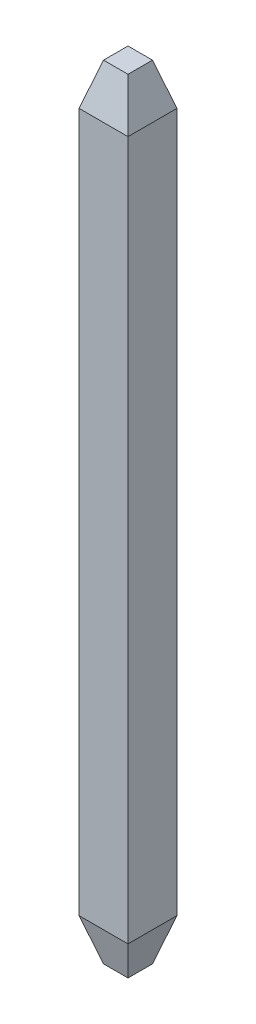
ISO-10303-21;
HEADER;
FILE_DESCRIPTION(('STEP AP214'),'2;1');
FILE_NAME('part.step','',(''),(''),'','','');
FILE_SCHEMA(('AUTOMOTIVE_DESIGN { 1 0 10303 214 1 1 1 1 }'));
ENDSEC;
DATA;
#1=APPLICATION_CONTEXT('core data for automotive mechanical design processes');
#2=APPLICATION_PROTOCOL_DEFINITION('international standard','automotive_design',2000,#1);
#3=PRODUCT_CONTEXT('',#1,'mechanical');
#4=PRODUCT('Part','Part','',(#3));
#5=PRODUCT_RELATED_PRODUCT_CATEGORY('part','',(#4));
#6=PRODUCT_DEFINITION_FORMATION('','',#4);
#7=PRODUCT_DEFINITION_CONTEXT('part definition',#1,'design');
#8=PRODUCT_DEFINITION('design','',#6,#7);
#9=PRODUCT_DEFINITION_SHAPE('','',#8);
#10=(LENGTH_UNIT() NAMED_UNIT(*) SI_UNIT(.MILLI.,.METRE.));
#11=(NAMED_UNIT(*) PLANE_ANGLE_UNIT() SI_UNIT($,.RADIAN.));
#12=(NAMED_UNIT(*) SI_UNIT($,.STERADIAN.) SOLID_ANGLE_UNIT());
#13=UNCERTAINTY_MEASURE_WITH_UNIT(LENGTH_MEASURE(1.E-05),#10,'distance_accuracy_value','');
#14=(GEOMETRIC_REPRESENTATION_CONTEXT(3) GLOBAL_UNCERTAINTY_ASSIGNED_CONTEXT((#13)) GLOBAL_UNIT_ASSIGNED_CONTEXT((#10,
#11,#12)) REPRESENTATION_CONTEXT('',''));
#15=CARTESIAN_POINT('',(0.,0.,0.));
#16=DIRECTION('',(0.,0.,1.));
#17=DIRECTION('',(1.,0.,0.));
#18=AXIS2_PLACEMENT_3D('',#15,#16,#17);
#19=CARTESIAN_POINT('',(-19.209999999987,-5.53543505344796,-16.6589999999763));
#20=DIRECTION('',(-1.,0.,0.));
#21=DIRECTION('',(0.,0.,1.));
#22=AXIS2_PLACEMENT_3D('',#19,#20,#21);
#23=PLANE('',#22);
#24=DIRECTION('',(0.,1.,0.));
#25=VECTOR('',#24,1.);
#26=CARTESIAN_POINT('',(-19.209999999987,-10.1039999999832,-17.2999999999763));
#27=LINE('',#26,#25);
#28=CARTESIAN_POINT('',(-19.209999999987,-10.1039999999832,-17.2999999999763));
#29=VERTEX_POINT('',#28);
#30=CARTESIAN_POINT('',(-19.209999999987,-0.965870106912723,-17.2999999999763));
#31=VERTEX_POINT('',#30);
#32=EDGE_CURVE('E152',#29,#31,#27,.T.);
#33=ORIENTED_EDGE('',*,*,#32,.F.);
#34=DIRECTION('',(0.,0.,-1.));
#35=VECTOR('',#34,1.);
#36=CARTESIAN_POINT('',(-19.209999999987,-10.1039999999832,-16.6599999999763));
#37=LINE('',#36,#35);
#38=CARTESIAN_POINT('',(-19.209999999987,-10.1039999999832,-16.6599999999763));
#39=VERTEX_POINT('',#38);
#40=EDGE_CURVE('E21',#39,#29,#37,.T.);
#41=ORIENTED_EDGE('',*,*,#40,.F.);
#42=DIRECTION('',(0.,1.,0.));
#43=VECTOR('',#42,1.);
#44=CARTESIAN_POINT('',(-19.209999999987,-10.1039999999832,-16.6599999999763));
#45=LINE('',#44,#43);
#46=CARTESIAN_POINT('',(-19.209999999987,-0.965870106912723,-16.6599999999763));
#47=VERTEX_POINT('',#46);
#48=EDGE_CURVE('E11',#39,#47,#45,.T.);
#49=ORIENTED_EDGE('',*,*,#48,.T.);
#50=DIRECTION('',(0.,0.,-1.));
#51=VECTOR('',#50,1.);
#52=CARTESIAN_POINT('',(-19.209999999987,-0.965870106912721,-16.6599999999763));
#53=LINE('',#52,#51);
#54=EDGE_CURVE('E27',#47,#31,#53,.T.);
#55=ORIENTED_EDGE('',*,*,#54,.T.);
#56=EDGE_LOOP('',(#33,#41,#49,#55));
#57=FACE_BOUND('',#56,.T.);
#58=ADVANCED_FACE('F17',(#57),#23,.T.);
#59=CARTESIAN_POINT('',(-18.568999999987,-5.53443505344796,-17.2999999999763));
#60=DIRECTION('',(0.,0.,-1.));
#61=DIRECTION('',(0.,-1.,0.));
#62=AXIS2_PLACEMENT_3D('',#59,#60,#61);
#63=PLANE('',#62);
#64=DIRECTION('',(0.,1.,0.));
#65=VECTOR('',#64,1.);
#66=CARTESIAN_POINT('',(-18.569999999987,-10.1039999999832,-17.2999999999763));
#67=LINE('',#66,#65);
#68=CARTESIAN_POINT('',(-18.569999999987,-10.1039999999832,-17.2999999999763));
#69=VERTEX_POINT('',#68);
#70=CARTESIAN_POINT('',(-18.569999999987,-0.965870106912723,-17.2999999999763));
#71=VERTEX_POINT('',#70);
#72=EDGE_CURVE('E216',#69,#71,#67,.T.);
#73=ORIENTED_EDGE('',*,*,#72,.F.);
#74=DIRECTION('',(1.,0.,0.));
#75=VECTOR('',#74,1.);
#76=CARTESIAN_POINT('',(-19.209999999987,-10.1039999999832,-17.2999999999763));
#77=LINE('',#76,#75);
#78=EDGE_CURVE('E162',#29,#69,#77,.T.);
#79=ORIENTED_EDGE('',*,*,#78,.F.);
#80=ORIENTED_EDGE('',*,*,#32,.T.);
#81=DIRECTION('',(1.,0.,0.));
#82=VECTOR('',#81,1.);
#83=CARTESIAN_POINT('',(-19.209999999987,-0.965870106912721,-17.2999999999763));
#84=LINE('',#83,#82);
#85=EDGE_CURVE('E156',#31,#71,#84,.T.);
#86=ORIENTED_EDGE('',*,*,#85,.T.);
#87=EDGE_LOOP('',(#73,#79,#80,#86));
#88=FACE_BOUND('',#87,.T.);
#89=ADVANCED_FACE('F245',(#88),#63,.T.);
#90=CARTESIAN_POINT('',(-18.569999999987,-11.0738701069127,-16.9799999999763));
#91=DIRECTION('',(1.,0.,0.));
#92=DIRECTION('',(0.,1.,0.));
#93=AXIS2_PLACEMENT_3D('',#90,#91,#92);
#94=PLANE('',#93);
#95=DIRECTION('',(0.,1.,0.));
#96=VECTOR('',#95,1.);
#97=CARTESIAN_POINT('',(-18.569999999987,-10.1039999999832,-16.6599999999763));
#98=LINE('',#97,#96);
#99=CARTESIAN_POINT('',(-18.569999999987,-10.1039999999832,-16.6599999999763));
#100=VERTEX_POINT('',#99);
#101=CARTESIAN_POINT('',(-18.569999999987,-0.965870106912723,-16.6599999999763));
#102=VERTEX_POINT('',#101);
#103=EDGE_CURVE('E76',#100,#102,#98,.T.);
#104=ORIENTED_EDGE('',*,*,#103,.F.);
#105=DIRECTION('',(0.,0.,1.));
#106=VECTOR('',#105,1.);
#107=CARTESIAN_POINT('',(-18.569999999987,-10.1039999999832,-17.2999999999763));
#108=LINE('',#107,#106);
#109=EDGE_CURVE('E206',#69,#100,#108,.T.);
#110=ORIENTED_EDGE('',*,*,#109,.F.);
#111=ORIENTED_EDGE('',*,*,#72,.T.);
#112=DIRECTION('',(0.,0.,1.));
#113=VECTOR('',#112,1.);
#114=CARTESIAN_POINT('',(-18.569999999987,-0.965870106912721,-17.2999999999763));
#115=LINE('',#114,#113);
#116=EDGE_CURVE('E64',#71,#102,#115,.T.);
#117=ORIENTED_EDGE('',*,*,#116,.T.);
#118=EDGE_LOOP('',(#104,#110,#111,#117));
#119=FACE_BOUND('',#118,.T.);
#120=ADVANCED_FACE('F252',(#119),#94,.T.);
#121=CARTESIAN_POINT('',(-18.569999999987,-0.965870106912721,-16.9799999999763));
#122=DIRECTION('',(0.959644900900968,0.281214622974643,0.));
#123=DIRECTION('',(0.,0.,-1.));
#124=AXIS2_PLACEMENT_3D('',#121,#122,#123);
#125=PLANE('',#124);
#126=DIRECTION('',(-0.270714017147727,0.923811583516617,0.270714017147727));
#127=VECTOR('',#126,1.);
#128=CARTESIAN_POINT('',(-18.569999999987,-0.965870106912721,-17.2999999999763));
#129=LINE('',#128,#127);
#130=CARTESIAN_POINT('',(-18.729999999987,-0.419870106912724,-17.1399999999763));
#131=VERTEX_POINT('',#130);
#132=EDGE_CURVE('E166',#71,#131,#129,.T.);
#133=ORIENTED_EDGE('',*,*,#132,.T.);
#134=DIRECTION('',(0.,0.,1.));
#135=VECTOR('',#134,1.);
#136=CARTESIAN_POINT('',(-18.729999999987,-0.419870106912722,-17.1399999999763));
#137=LINE('',#136,#135);
#138=CARTESIAN_POINT('',(-18.729999999987,-0.419870106912724,-16.8199999999763));
#139=VERTEX_POINT('',#138);
#140=EDGE_CURVE('E163',#131,#139,#137,.T.);
#141=ORIENTED_EDGE('',*,*,#140,.T.);
#142=DIRECTION('',(-0.270714017147727,0.923811583516617,-0.270714017147727));
#143=VECTOR('',#142,1.);
#144=CARTESIAN_POINT('',(-18.569999999987,-0.965870106912721,-16.6599999999763));
#145=LINE('',#144,#143);
#146=EDGE_CURVE('E167',#102,#139,#145,.T.);
#147=ORIENTED_EDGE('',*,*,#146,.F.);
#148=ORIENTED_EDGE('',*,*,#116,.F.);
#149=EDGE_LOOP('',(#133,#141,#147,#148));
#150=FACE_BOUND('',#149,.T.);
#151=ADVANCED_FACE('F271',(#150),#125,.T.);
#152=CARTESIAN_POINT('',(-18.889999999987,-0.965870106912721,-16.6599999999763));
#153=DIRECTION('',(0.,0.281214622974643,0.959644900900968));
#154=DIRECTION('',(1.,0.,0.));
#155=AXIS2_PLACEMENT_3D('',#152,#153,#154);
#156=PLANE('',#155);
#157=ORIENTED_EDGE('',*,*,#146,.T.);
#158=DIRECTION('',(-1.,0.,0.));
#159=VECTOR('',#158,1.);
#160=CARTESIAN_POINT('',(-18.729999999987,-0.419870106912722,-16.8199999999763));
#161=LINE('',#160,#159);
#162=CARTESIAN_POINT('',(-19.049999999987,-0.419870106912724,-16.8199999999763));
#163=VERTEX_POINT('',#162);
#164=EDGE_CURVE('E188',#139,#163,#161,.T.);
#165=ORIENTED_EDGE('',*,*,#164,.T.);
#166=DIRECTION('',(0.270714017147727,0.923811583516617,-0.270714017147727));
#167=VECTOR('',#166,1.);
#168=CARTESIAN_POINT('',(-19.209999999987,-0.965870106912721,-16.6599999999763));
#169=LINE('',#168,#167);
#170=EDGE_CURVE('E168',#47,#163,#169,.T.);
#171=ORIENTED_EDGE('',*,*,#170,.F.);
#172=DIRECTION('',(-1.,0.,0.));
#173=VECTOR('',#172,1.);
#174=CARTESIAN_POINT('',(-18.569999999987,-0.965870106912721,-16.6599999999763));
#175=LINE('',#174,#173);
#176=EDGE_CURVE('E148',#102,#47,#175,.T.);
#177=ORIENTED_EDGE('',*,*,#176,.F.);
#178=EDGE_LOOP('',(#157,#165,#171,#177));
#179=FACE_BOUND('',#178,.T.);
#180=ADVANCED_FACE('F238',(#179),#156,.T.);
#181=CARTESIAN_POINT('',(-18.889999999987,-0.419870106912722,-17.1409999999763));
#182=DIRECTION('',(0.,1.,0.));
#183=DIRECTION('',(1.,0.,0.));
#184=AXIS2_PLACEMENT_3D('',#181,#182,#183);
#185=PLANE('',#184);
#186=DIRECTION('',(1.,0.,0.));
#187=VECTOR('',#186,1.);
#188=CARTESIAN_POINT('',(-19.049999999987,-0.419870106912722,-17.1399999999763));
#189=LINE('',#188,#187);
#190=CARTESIAN_POINT('',(-19.049999999987,-0.419870106912724,-17.1399999999763));
#191=VERTEX_POINT('',#190);
#192=EDGE_CURVE('E157',#191,#131,#189,.T.);
#193=ORIENTED_EDGE('',*,*,#192,.F.);
#194=DIRECTION('',(0.,0.,-1.));
#195=VECTOR('',#194,1.);
#196=CARTESIAN_POINT('',(-19.049999999987,-0.419870106912722,-16.8199999999763));
#197=LINE('',#196,#195);
#198=EDGE_CURVE('E170',#163,#191,#197,.T.);
#199=ORIENTED_EDGE('',*,*,#198,.F.);
#200=ORIENTED_EDGE('',*,*,#164,.F.);
#201=ORIENTED_EDGE('',*,*,#140,.F.);
#202=EDGE_LOOP('',(#193,#199,#200,#201));
#203=FACE_BOUND('',#202,.T.);
#204=ADVANCED_FACE('F257',(#203),#185,.T.);
#205=CARTESIAN_POINT('',(-18.569999999987,-10.1039999999832,-16.9799999999763));
#206=DIRECTION('',(0.959644900900968,-0.281214622974643,0.));
#207=DIRECTION('',(0.,0.,-1.));
#208=AXIS2_PLACEMENT_3D('',#205,#206,#207);
#209=PLANE('',#208);
#210=ORIENTED_EDGE('',*,*,#109,.T.);
#211=DIRECTION('',(-0.270714017147727,-0.923811583516618,-0.270714017147727));
#212=VECTOR('',#211,1.);
#213=CARTESIAN_POINT('',(-18.569999999987,-10.1039999999832,-16.6599999999763));
#214=LINE('',#213,#212);
#215=CARTESIAN_POINT('',(-18.729999999987,-10.6499999999832,-16.8199999999763));
#216=VERTEX_POINT('',#215);
#217=EDGE_CURVE('E200',#100,#216,#214,.T.);
#218=ORIENTED_EDGE('',*,*,#217,.T.);
#219=DIRECTION('',(0.,0.,1.));
#220=VECTOR('',#219,1.);
#221=CARTESIAN_POINT('',(-18.729999999987,-10.6499999999832,-17.1399999999763));
#222=LINE('',#221,#220);
#223=CARTESIAN_POINT('',(-18.729999999987,-10.6499999999832,-17.1399999999763));
#224=VERTEX_POINT('',#223);
#225=EDGE_CURVE('E198',#224,#216,#222,.T.);
#226=ORIENTED_EDGE('',*,*,#225,.F.);
#227=DIRECTION('',(-0.270714017147727,-0.923811583516618,0.270714017147727));
#228=VECTOR('',#227,1.);
#229=CARTESIAN_POINT('',(-18.569999999987,-10.1039999999832,-17.2999999999763));
#230=LINE('',#229,#228);
#231=EDGE_CURVE('E112',#69,#224,#230,.T.);
#232=ORIENTED_EDGE('',*,*,#231,.F.);
#233=EDGE_LOOP('',(#210,#218,#226,#232));
#234=FACE_BOUND('',#233,.T.);
#235=ADVANCED_FACE('F268',(#234),#209,.T.);
#236=CARTESIAN_POINT('',(-19.050999999987,-10.6499999999832,-16.9799999999763));
#237=DIRECTION('',(0.,-1.,0.));
#238=DIRECTION('',(0.,0.,-1.));
#239=AXIS2_PLACEMENT_3D('',#236,#237,#238);
#240=PLANE('',#239);
#241=ORIENTED_EDGE('',*,*,#225,.T.);
#242=DIRECTION('',(-1.,0.,0.));
#243=VECTOR('',#242,1.);
#244=CARTESIAN_POINT('',(-18.729999999987,-10.6499999999832,-16.8199999999763));
#245=LINE('',#244,#243);
#246=CARTESIAN_POINT('',(-19.049999999987,-10.6499999999832,-16.8199999999763));
#247=VERTEX_POINT('',#246);
#248=EDGE_CURVE('E138',#216,#247,#245,.T.);
#249=ORIENTED_EDGE('',*,*,#248,.T.);
#250=DIRECTION('',(0.,0.,-1.));
#251=VECTOR('',#250,1.);
#252=CARTESIAN_POINT('',(-19.049999999987,-10.6499999999832,-16.8199999999763));
#253=LINE('',#252,#251);
#254=CARTESIAN_POINT('',(-19.049999999987,-10.6499999999832,-17.1399999999763));
#255=VERTEX_POINT('',#254);
#256=EDGE_CURVE('E123',#247,#255,#253,.T.);
#257=ORIENTED_EDGE('',*,*,#256,.T.);
#258=DIRECTION('',(1.,0.,0.));
#259=VECTOR('',#258,1.);
#260=CARTESIAN_POINT('',(-19.049999999987,-10.6499999999832,-17.1399999999763));
#261=LINE('',#260,#259);
#262=EDGE_CURVE('E129',#255,#224,#261,.T.);
#263=ORIENTED_EDGE('',*,*,#262,.T.);
#264=EDGE_LOOP('',(#241,#249,#257,#263));
#265=FACE_BOUND('',#264,.T.);
#266=ADVANCED_FACE('F136',(#265),#240,.T.);
#267=CARTESIAN_POINT('',(-18.889999999987,-10.1039999999832,-16.6599999999763));
#268=DIRECTION('',(0.,-0.281214622974643,0.959644900900968));
#269=DIRECTION('',(-1.,0.,0.));
#270=AXIS2_PLACEMENT_3D('',#267,#268,#269);
#271=PLANE('',#270);
#272=DIRECTION('',(-1.,0.,0.));
#273=VECTOR('',#272,1.);
#274=CARTESIAN_POINT('',(-18.569999999987,-10.1039999999832,-16.6599999999763));
#275=LINE('',#274,#273);
#276=EDGE_CURVE('E134',#100,#39,#275,.T.);
#277=ORIENTED_EDGE('',*,*,#276,.T.);
#278=DIRECTION('',(0.270714017147727,-0.923811583516618,-0.270714017147727));
#279=VECTOR('',#278,1.);
#280=CARTESIAN_POINT('',(-19.209999999987,-10.1039999999832,-16.6599999999763));
#281=LINE('',#280,#279);
#282=EDGE_CURVE('E192',#39,#247,#281,.T.);
#283=ORIENTED_EDGE('',*,*,#282,.T.);
#284=ORIENTED_EDGE('',*,*,#248,.F.);
#285=ORIENTED_EDGE('',*,*,#217,.F.);
#286=EDGE_LOOP('',(#277,#283,#284,#285));
#287=FACE_BOUND('',#286,.T.);
#288=ADVANCED_FACE('F259',(#287),#271,.T.);
#289=CARTESIAN_POINT('',(-18.889999999987,-0.965870106912721,-17.2999999999763));
#290=DIRECTION('',(0.,0.281214622974643,-0.959644900900968));
#291=DIRECTION('',(-1.,0.,0.));
#292=AXIS2_PLACEMENT_3D('',#289,#290,#291);
#293=PLANE('',#292);
#294=DIRECTION('',(0.270714017147727,0.923811583516617,0.270714017147727));
#295=VECTOR('',#294,1.);
#296=CARTESIAN_POINT('',(-19.209999999987,-0.965870106912721,-17.2999999999763));
#297=LINE('',#296,#295);
#298=EDGE_CURVE('E161',#31,#191,#297,.T.);
#299=ORIENTED_EDGE('',*,*,#298,.T.);
#300=ORIENTED_EDGE('',*,*,#192,.T.);
#301=ORIENTED_EDGE('',*,*,#132,.F.);
#302=ORIENTED_EDGE('',*,*,#85,.F.);
#303=EDGE_LOOP('',(#299,#300,#301,#302));
#304=FACE_BOUND('',#303,.T.);
#305=ADVANCED_FACE('F262',(#304),#293,.T.);
#306=CARTESIAN_POINT('',(-18.889999999987,-10.1039999999832,-17.2999999999763));
#307=DIRECTION('',(0.,-0.281214622974643,-0.959644900900968));
#308=DIRECTION('',(0.,-0.959644900900968,0.281214622974643));
#309=AXIS2_PLACEMENT_3D('',#306,#307,#308);
#310=PLANE('',#309);
#311=ORIENTED_EDGE('',*,*,#78,.T.);
#312=ORIENTED_EDGE('',*,*,#231,.T.);
#313=ORIENTED_EDGE('',*,*,#262,.F.);
#314=DIRECTION('',(0.270714017147727,-0.923811583516618,0.270714017147727));
#315=VECTOR('',#314,1.);
#316=CARTESIAN_POINT('',(-19.209999999987,-10.1039999999832,-17.2999999999763));
#317=LINE('',#316,#315);
#318=EDGE_CURVE('E131',#29,#255,#317,.T.);
#319=ORIENTED_EDGE('',*,*,#318,.F.);
#320=EDGE_LOOP('',(#311,#312,#313,#319));
#321=FACE_BOUND('',#320,.T.);
#322=ADVANCED_FACE('F130',(#321),#310,.T.);
#323=CARTESIAN_POINT('',(-19.209999999987,-0.965870106912721,-16.9799999999763));
#324=DIRECTION('',(-0.959644900900968,0.281214622974643,0.));
#325=DIRECTION('',(0.,0.,1.));
#326=AXIS2_PLACEMENT_3D('',#323,#324,#325);
#327=PLANE('',#326);
#328=ORIENTED_EDGE('',*,*,#170,.T.);
#329=ORIENTED_EDGE('',*,*,#198,.T.);
#330=ORIENTED_EDGE('',*,*,#298,.F.);
#331=ORIENTED_EDGE('',*,*,#54,.F.);
#332=EDGE_LOOP('',(#328,#329,#330,#331));
#333=FACE_BOUND('',#332,.T.);
#334=ADVANCED_FACE('F241',(#333),#327,.T.);
#335=CARTESIAN_POINT('',(-19.210999999987,-5.53543505344796,-16.6599999999763));
#336=DIRECTION('',(0.,0.,1.));
#337=DIRECTION('',(1.,0.,0.));
#338=AXIS2_PLACEMENT_3D('',#335,#336,#337);
#339=PLANE('',#338);
#340=ORIENTED_EDGE('',*,*,#48,.F.);
#341=ORIENTED_EDGE('',*,*,#276,.F.);
#342=ORIENTED_EDGE('',*,*,#103,.T.);
#343=ORIENTED_EDGE('',*,*,#176,.T.);
#344=EDGE_LOOP('',(#340,#341,#342,#343));
#345=FACE_BOUND('',#344,.T.);
#346=ADVANCED_FACE('F236',(#345),#339,.T.);
#347=CARTESIAN_POINT('',(-19.209999999987,-10.1039999999832,-16.9799999999763));
#348=DIRECTION('',(-0.959644900900968,-0.281214622974643,0.));
#349=DIRECTION('',(-0.281214622974643,0.959644900900968,0.));
#350=AXIS2_PLACEMENT_3D('',#347,#348,#349);
#351=PLANE('',#350);
#352=ORIENTED_EDGE('',*,*,#40,.T.);
#353=ORIENTED_EDGE('',*,*,#318,.T.);
#354=ORIENTED_EDGE('',*,*,#256,.F.);
#355=ORIENTED_EDGE('',*,*,#282,.F.);
#356=EDGE_LOOP('',(#352,#353,#354,#355));
#357=FACE_BOUND('',#356,.T.);
#358=ADVANCED_FACE('F19',(#357),#351,.T.);
#359=CLOSED_SHELL('',(#58,#89,#120,#151,#180,#204,#235,#266,#288,#305,#322,#334,#346,#358));
#360=MANIFOLD_SOLID_BREP('B1',#359);
#361=ADVANCED_BREP_SHAPE_REPRESENTATION('',(#18,#360),#14);
#362=SHAPE_DEFINITION_REPRESENTATION(#9,#361);
ENDSEC;
END-ISO-10303-21;
